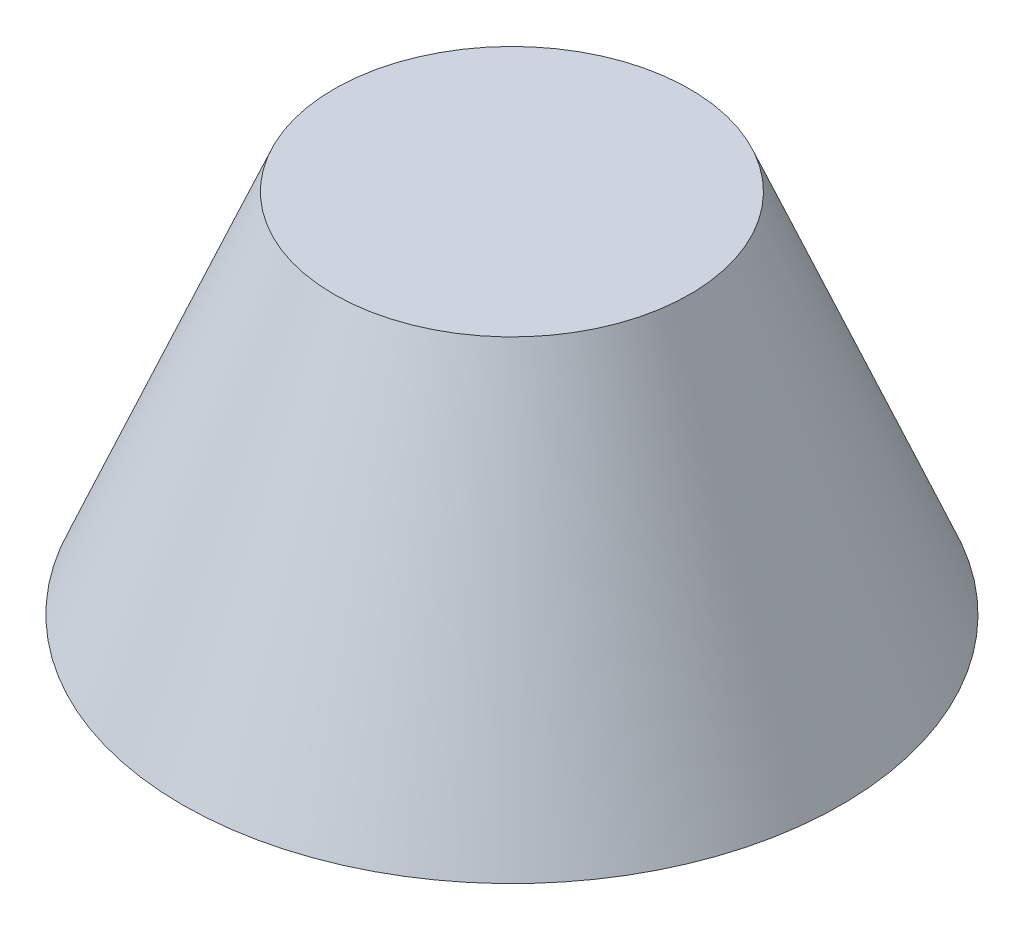
ISO-10303-21;
HEADER;
FILE_DESCRIPTION(('STEP AP214'),'2;1');
FILE_NAME('part.step','',(''),(''),'','','');
FILE_SCHEMA(('AUTOMOTIVE_DESIGN { 1 0 10303 214 1 1 1 1 }'));
ENDSEC;
DATA;
#1=APPLICATION_CONTEXT('core data for automotive mechanical design processes');
#2=APPLICATION_PROTOCOL_DEFINITION('international standard','automotive_design',2000,#1);
#3=PRODUCT_CONTEXT('',#1,'mechanical');
#4=PRODUCT('Part','Part','',(#3));
#5=PRODUCT_RELATED_PRODUCT_CATEGORY('part','',(#4));
#6=PRODUCT_DEFINITION_FORMATION('','',#4);
#7=PRODUCT_DEFINITION_CONTEXT('part definition',#1,'design');
#8=PRODUCT_DEFINITION('design','',#6,#7);
#9=PRODUCT_DEFINITION_SHAPE('','',#8);
#10=(LENGTH_UNIT() NAMED_UNIT(*) SI_UNIT(.MILLI.,.METRE.));
#11=(NAMED_UNIT(*) PLANE_ANGLE_UNIT() SI_UNIT($,.RADIAN.));
#12=(NAMED_UNIT(*) SI_UNIT($,.STERADIAN.) SOLID_ANGLE_UNIT());
#13=UNCERTAINTY_MEASURE_WITH_UNIT(LENGTH_MEASURE(1.E-05),#10,'distance_accuracy_value','');
#14=(GEOMETRIC_REPRESENTATION_CONTEXT(3) GLOBAL_UNCERTAINTY_ASSIGNED_CONTEXT((#13)) GLOBAL_UNIT_ASSIGNED_CONTEXT((#10,
#11,#12)) REPRESENTATION_CONTEXT('',''));
#15=CARTESIAN_POINT('',(0.,0.,0.));
#16=DIRECTION('',(0.,0.,1.));
#17=DIRECTION('',(1.,0.,0.));
#18=AXIS2_PLACEMENT_3D('',#15,#16,#17);
#19=CARTESIAN_POINT('',(0.,0.,0.));
#20=DIRECTION('',(0.,-1.,0.));
#21=DIRECTION('',(0.,0.,1.));
#22=AXIS2_PLACEMENT_3D('',#19,#20,#21);
#23=CONICAL_SURFACE('',#22,90.,0.392699081698725);
#24=CARTESIAN_POINT('',(0.,100.,0.));
#25=DIRECTION('',(0.,1.,0.));
#26=DIRECTION('',(0.,0.,1.));
#27=AXIS2_PLACEMENT_3D('',#24,#25,#26);
#28=CIRCLE('',#27,48.5786437626904);
#29=CARTESIAN_POINT('',(0.,100.,48.5786437626904));
#30=VERTEX_POINT('',#29);
#31=EDGE_CURVE('E10',#30,#30,#28,.T.);
#32=ORIENTED_EDGE('',*,*,#31,.F.);
#33=EDGE_LOOP('',(#32));
#34=FACE_BOUND('',#33,.T.);
#35=CARTESIAN_POINT('',(0.,0.,0.));
#36=DIRECTION('',(0.,1.,0.));
#37=DIRECTION('',(0.,0.,1.));
#38=AXIS2_PLACEMENT_3D('',#35,#36,#37);
#39=CIRCLE('',#38,90.);
#40=CARTESIAN_POINT('',(0.,0.,90.));
#41=VERTEX_POINT('',#40);
#42=EDGE_CURVE('E38',#41,#41,#39,.T.);
#43=ORIENTED_EDGE('',*,*,#42,.T.);
#44=EDGE_LOOP('',(#43));
#45=FACE_BOUND('',#44,.T.);
#46=ADVANCED_FACE('F32',(#34,#45),#23,.T.);
#47=CARTESIAN_POINT('',(0.,100.,0.));
#48=DIRECTION('',(0.,1.,0.));
#49=DIRECTION('',(0.,0.,1.));
#50=AXIS2_PLACEMENT_3D('',#47,#48,#49);
#51=PLANE('',#50);
#52=ORIENTED_EDGE('',*,*,#31,.T.);
#53=EDGE_LOOP('',(#52));
#54=FACE_BOUND('',#53,.T.);
#55=ADVANCED_FACE('F47',(#54),#51,.T.);
#56=CARTESIAN_POINT('',(0.,0.,0.));
#57=DIRECTION('',(0.,1.,0.));
#58=DIRECTION('',(0.,0.,1.));
#59=AXIS2_PLACEMENT_3D('',#56,#57,#58);
#60=PLANE('',#59);
#61=ORIENTED_EDGE('',*,*,#42,.F.);
#62=EDGE_LOOP('',(#61));
#63=FACE_BOUND('',#62,.T.);
#64=ADVANCED_FACE('F45',(#63),#60,.F.);
#65=CLOSED_SHELL('',(#46,#55,#64));
#66=MANIFOLD_SOLID_BREP('B2',#65);
#67=ADVANCED_BREP_SHAPE_REPRESENTATION('',(#18,#66),#14);
#68=SHAPE_DEFINITION_REPRESENTATION(#9,#67);
ENDSEC;
END-ISO-10303-21;
